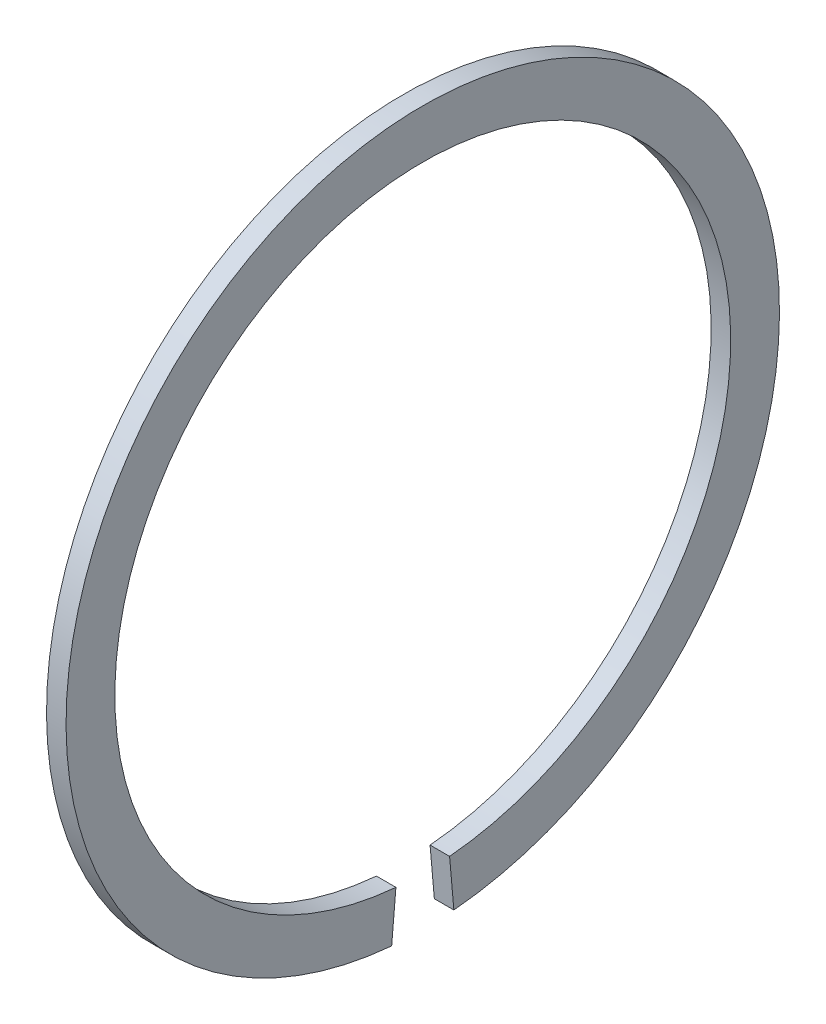
ISO-10303-21;
HEADER;
FILE_DESCRIPTION(('STEP AP214'),'2;1');
FILE_NAME('part.step','',(''),(''),'','','');
FILE_SCHEMA(('AUTOMOTIVE_DESIGN { 1 0 10303 214 1 1 1 1 }'));
ENDSEC;
DATA;
#1=APPLICATION_CONTEXT('core data for automotive mechanical design processes');
#2=APPLICATION_PROTOCOL_DEFINITION('international standard','automotive_design',2000,#1);
#3=PRODUCT_CONTEXT('',#1,'mechanical');
#4=PRODUCT('Part','Part','',(#3));
#5=PRODUCT_RELATED_PRODUCT_CATEGORY('part','',(#4));
#6=PRODUCT_DEFINITION_FORMATION('','',#4);
#7=PRODUCT_DEFINITION_CONTEXT('part definition',#1,'design');
#8=PRODUCT_DEFINITION('design','',#6,#7);
#9=PRODUCT_DEFINITION_SHAPE('','',#8);
#10=(LENGTH_UNIT() NAMED_UNIT(*) SI_UNIT(.MILLI.,.METRE.));
#11=(NAMED_UNIT(*) PLANE_ANGLE_UNIT() SI_UNIT($,.RADIAN.));
#12=(NAMED_UNIT(*) SI_UNIT($,.STERADIAN.) SOLID_ANGLE_UNIT());
#13=UNCERTAINTY_MEASURE_WITH_UNIT(LENGTH_MEASURE(1.E-05),#10,'distance_accuracy_value','');
#14=(GEOMETRIC_REPRESENTATION_CONTEXT(3) GLOBAL_UNCERTAINTY_ASSIGNED_CONTEXT((#13)) GLOBAL_UNIT_ASSIGNED_CONTEXT((#10,
#11,#12)) REPRESENTATION_CONTEXT('',''));
#15=CARTESIAN_POINT('',(0.,0.,0.));
#16=DIRECTION('',(0.,0.,1.));
#17=DIRECTION('',(1.,0.,0.));
#18=AXIS2_PLACEMENT_3D('',#15,#16,#17);
#19=CARTESIAN_POINT('',(1.35,0.,0.));
#20=DIRECTION('',(1.,0.,0.));
#21=DIRECTION('',(0.,0.,-1.));
#22=AXIS2_PLACEMENT_3D('',#19,#20,#21);
#23=PLANE('',#22);
#24=DIRECTION('',(0.,-0.996194698091746,-0.0871557427476581));
#25=VECTOR('',#24,1.);
#26=CARTESIAN_POINT('',(1.35,-15.2915886157083,-1.33784065117655));
#27=LINE('',#26,#25);
#28=CARTESIAN_POINT('',(1.35,-13.1995797497156,-1.15481359140647));
#29=VERTEX_POINT('',#28);
#30=CARTESIAN_POINT('',(1.35,-15.2915886157083,-1.33784065117655));
#31=VERTEX_POINT('',#30);
#32=EDGE_CURVE('E59',#29,#31,#27,.T.);
#33=ORIENTED_EDGE('',*,*,#32,.F.);
#34=CARTESIAN_POINT('',(1.35,0.,0.));
#35=DIRECTION('',(-1.,0.,0.));
#36=DIRECTION('',(0.,0.,1.));
#37=AXIS2_PLACEMENT_3D('',#34,#35,#36);
#38=CIRCLE('',#37,13.25);
#39=CARTESIAN_POINT('',(1.35,-13.1995797497156,1.15481359140647));
#40=VERTEX_POINT('',#39);
#41=EDGE_CURVE('E82',#29,#40,#38,.F.);
#42=ORIENTED_EDGE('',*,*,#41,.T.);
#43=DIRECTION('',(0.,0.996194698091746,-0.0871557427476583));
#44=VECTOR('',#43,1.);
#45=CARTESIAN_POINT('',(1.35,-13.1995797497156,1.15481359140647));
#46=LINE('',#45,#44);
#47=CARTESIAN_POINT('',(1.35,-15.2915886157083,1.33784065117656));
#48=VERTEX_POINT('',#47);
#49=EDGE_CURVE('E61',#48,#40,#46,.T.);
#50=ORIENTED_EDGE('',*,*,#49,.F.);
#51=CARTESIAN_POINT('',(1.35,0.,0.));
#52=DIRECTION('',(-1.,0.,0.));
#53=DIRECTION('',(0.,0.,1.));
#54=AXIS2_PLACEMENT_3D('',#51,#52,#53);
#55=CIRCLE('',#54,15.35);
#56=EDGE_CURVE('E20',#31,#48,#55,.F.);
#57=ORIENTED_EDGE('',*,*,#56,.F.);
#58=EDGE_LOOP('',(#33,#42,#50,#57));
#59=FACE_BOUND('',#58,.T.);
#60=ADVANCED_FACE('F17',(#59),#23,.F.);
#61=CARTESIAN_POINT('',(1.35,-15.2915886157083,-1.33784065117655));
#62=DIRECTION('',(0.,-0.0871557427476581,0.996194698091746));
#63=DIRECTION('',(0.,-0.996194698091746,-0.0871557427476581));
#64=AXIS2_PLACEMENT_3D('',#61,#62,#63);
#65=PLANE('',#64);
#66=ORIENTED_EDGE('',*,*,#32,.T.);
#67=DIRECTION('',(-1.,0.,0.));
#68=VECTOR('',#67,1.);
#69=CARTESIAN_POINT('',(1.35,-15.2915886157083,-1.33784065117655));
#70=LINE('',#69,#68);
#71=CARTESIAN_POINT('',(2.19,-15.2915886157083,-1.33784065117655));
#72=VERTEX_POINT('',#71);
#73=EDGE_CURVE('E64',#72,#31,#70,.T.);
#74=ORIENTED_EDGE('',*,*,#73,.F.);
#75=DIRECTION('',(0.,-0.996194698091746,-0.0871557427476556));
#76=VECTOR('',#75,1.);
#77=CARTESIAN_POINT('',(2.19,-13.1995797497156,-1.15481359140647));
#78=LINE('',#77,#76);
#79=CARTESIAN_POINT('',(2.19,-13.1995797497156,-1.15481359140647));
#80=VERTEX_POINT('',#79);
#81=EDGE_CURVE('E81',#80,#72,#78,.T.);
#82=ORIENTED_EDGE('',*,*,#81,.F.);
#83=DIRECTION('',(-1.,0.,0.));
#84=VECTOR('',#83,1.);
#85=CARTESIAN_POINT('',(1.35,-13.1995797497156,-1.15481359140647));
#86=LINE('',#85,#84);
#87=EDGE_CURVE('E70',#80,#29,#86,.T.);
#88=ORIENTED_EDGE('',*,*,#87,.T.);
#89=EDGE_LOOP('',(#66,#74,#82,#88));
#90=FACE_BOUND('',#89,.T.);
#91=ADVANCED_FACE('F66',(#90),#65,.T.);
#92=CARTESIAN_POINT('',(1.35,0.,0.));
#93=DIRECTION('',(-1.,0.,0.));
#94=DIRECTION('',(0.,0.,1.));
#95=AXIS2_PLACEMENT_3D('',#92,#93,#94);
#96=CYLINDRICAL_SURFACE('',#95,15.35);
#97=DIRECTION('',(1.,0.,0.));
#98=VECTOR('',#97,1.);
#99=CARTESIAN_POINT('',(1.35,-15.2915886157083,1.33784065117656));
#100=LINE('',#99,#98);
#101=CARTESIAN_POINT('',(2.19,-15.2915886157083,1.33784065117655));
#102=VERTEX_POINT('',#101);
#103=EDGE_CURVE('E63',#102,#48,#100,.F.);
#104=ORIENTED_EDGE('',*,*,#103,.F.);
#105=CARTESIAN_POINT('',(2.19,0.,0.));
#106=DIRECTION('',(-1.,0.,0.));
#107=DIRECTION('',(0.,0.,1.));
#108=AXIS2_PLACEMENT_3D('',#105,#106,#107);
#109=CIRCLE('',#108,15.35);
#110=EDGE_CURVE('E74',#72,#102,#109,.F.);
#111=ORIENTED_EDGE('',*,*,#110,.F.);
#112=ORIENTED_EDGE('',*,*,#73,.T.);
#113=ORIENTED_EDGE('',*,*,#56,.T.);
#114=EDGE_LOOP('',(#104,#111,#112,#113));
#115=FACE_BOUND('',#114,.T.);
#116=ADVANCED_FACE('F73',(#115),#96,.T.);
#117=CARTESIAN_POINT('',(1.35,-13.1995797497156,1.15481359140647));
#118=DIRECTION('',(0.,-0.0871557427476583,-0.996194698091746));
#119=DIRECTION('',(0.,0.996194698091746,-0.0871557427476583));
#120=AXIS2_PLACEMENT_3D('',#117,#118,#119);
#121=PLANE('',#120);
#122=ORIENTED_EDGE('',*,*,#49,.T.);
#123=DIRECTION('',(-1.,0.,0.));
#124=VECTOR('',#123,1.);
#125=CARTESIAN_POINT('',(1.35,-13.1995797497156,1.15481359140647));
#126=LINE('',#125,#124);
#127=CARTESIAN_POINT('',(2.19,-13.1995797497156,1.15481359140647));
#128=VERTEX_POINT('',#127);
#129=EDGE_CURVE('E35',#40,#128,#126,.F.);
#130=ORIENTED_EDGE('',*,*,#129,.T.);
#131=DIRECTION('',(0.,0.996194698091746,-0.0871557427476556));
#132=VECTOR('',#131,1.);
#133=CARTESIAN_POINT('',(2.19,-15.2915886157083,1.33784065117655));
#134=LINE('',#133,#132);
#135=EDGE_CURVE('E26',#102,#128,#134,.T.);
#136=ORIENTED_EDGE('',*,*,#135,.F.);
#137=ORIENTED_EDGE('',*,*,#103,.T.);
#138=EDGE_LOOP('',(#122,#130,#136,#137));
#139=FACE_BOUND('',#138,.T.);
#140=ADVANCED_FACE('F89',(#139),#121,.T.);
#141=CARTESIAN_POINT('',(1.35,0.,0.));
#142=DIRECTION('',(-1.,0.,0.));
#143=DIRECTION('',(0.,0.,1.));
#144=AXIS2_PLACEMENT_3D('',#141,#142,#143);
#145=CYLINDRICAL_SURFACE('',#144,13.25);
#146=ORIENTED_EDGE('',*,*,#41,.F.);
#147=ORIENTED_EDGE('',*,*,#87,.F.);
#148=CARTESIAN_POINT('',(2.19,0.,0.));
#149=DIRECTION('',(-1.,0.,0.));
#150=DIRECTION('',(0.,0.,1.));
#151=AXIS2_PLACEMENT_3D('',#148,#149,#150);
#152=CIRCLE('',#151,13.25);
#153=EDGE_CURVE('E11',#128,#80,#152,.T.);
#154=ORIENTED_EDGE('',*,*,#153,.F.);
#155=ORIENTED_EDGE('',*,*,#129,.F.);
#156=EDGE_LOOP('',(#146,#147,#154,#155));
#157=FACE_BOUND('',#156,.T.);
#158=ADVANCED_FACE('F91',(#157),#145,.F.);
#159=CARTESIAN_POINT('',(2.19,0.,0.));
#160=DIRECTION('',(1.,0.,0.));
#161=DIRECTION('',(0.,0.,-1.));
#162=AXIS2_PLACEMENT_3D('',#159,#160,#161);
#163=PLANE('',#162);
#164=ORIENTED_EDGE('',*,*,#153,.T.);
#165=ORIENTED_EDGE('',*,*,#81,.T.);
#166=ORIENTED_EDGE('',*,*,#110,.T.);
#167=ORIENTED_EDGE('',*,*,#135,.T.);
#168=EDGE_LOOP('',(#164,#165,#166,#167));
#169=FACE_BOUND('',#168,.T.);
#170=ADVANCED_FACE('F88',(#169),#163,.T.);
#171=CLOSED_SHELL('',(#60,#91,#116,#140,#158,#170));
#172=MANIFOLD_SOLID_BREP('B1',#171);
#173=ADVANCED_BREP_SHAPE_REPRESENTATION('',(#18,#172),#14);
#174=SHAPE_DEFINITION_REPRESENTATION(#9,#173);
ENDSEC;
END-ISO-10303-21;
